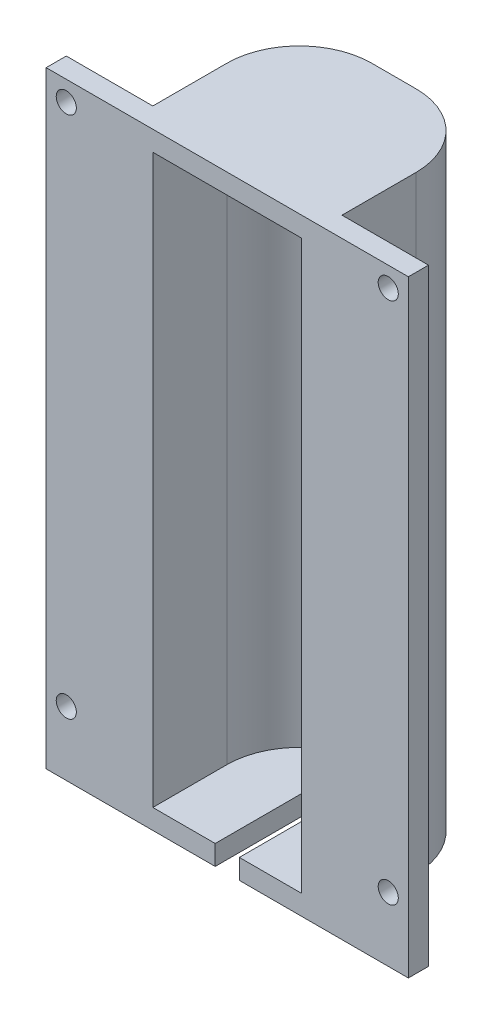
ISO-10303-21;
HEADER;
FILE_DESCRIPTION(('STEP AP214'),'2;1');
FILE_NAME('part.step','',(''),(''),'','','');
FILE_SCHEMA(('AUTOMOTIVE_DESIGN { 1 0 10303 214 1 1 1 1 }'));
ENDSEC;
DATA;
#1=APPLICATION_CONTEXT('core data for automotive mechanical design processes');
#2=APPLICATION_PROTOCOL_DEFINITION('international standard','automotive_design',2000,#1);
#3=PRODUCT_CONTEXT('',#1,'mechanical');
#4=PRODUCT('Part','Part','',(#3));
#5=PRODUCT_RELATED_PRODUCT_CATEGORY('part','',(#4));
#6=PRODUCT_DEFINITION_FORMATION('','',#4);
#7=PRODUCT_DEFINITION_CONTEXT('part definition',#1,'design');
#8=PRODUCT_DEFINITION('design','',#6,#7);
#9=PRODUCT_DEFINITION_SHAPE('','',#8);
#10=(LENGTH_UNIT() NAMED_UNIT(*) SI_UNIT(.MILLI.,.METRE.));
#11=(NAMED_UNIT(*) PLANE_ANGLE_UNIT() SI_UNIT($,.RADIAN.));
#12=(NAMED_UNIT(*) SI_UNIT($,.STERADIAN.) SOLID_ANGLE_UNIT());
#13=UNCERTAINTY_MEASURE_WITH_UNIT(LENGTH_MEASURE(1.E-05),#10,'distance_accuracy_value','');
#14=(GEOMETRIC_REPRESENTATION_CONTEXT(3) GLOBAL_UNCERTAINTY_ASSIGNED_CONTEXT((#13)) GLOBAL_UNIT_ASSIGNED_CONTEXT((#10,
#11,#12)) REPRESENTATION_CONTEXT('',''));
#15=CARTESIAN_POINT('',(0.,0.,0.));
#16=DIRECTION('',(0.,0.,1.));
#17=DIRECTION('',(1.,0.,0.));
#18=AXIS2_PLACEMENT_3D('',#15,#16,#17);
#19=CARTESIAN_POINT('',(0.,0.,18.2));
#20=DIRECTION('',(0.,0.,1.));
#21=DIRECTION('',(1.,0.,0.));
#22=AXIS2_PLACEMENT_3D('',#19,#20,#21);
#23=PLANE('',#22);
#24=CARTESIAN_POINT('',(20.0000467181837,35.25,18.2));
#25=DIRECTION('',(0.,0.,-1.));
#26=DIRECTION('',(-1.,0.,0.));
#27=AXIS2_PLACEMENT_3D('',#24,#25,#26);
#28=CIRCLE('',#27,1.24999999999999);
#29=CARTESIAN_POINT('',(18.7500467181837,35.25,18.2));
#30=VERTEX_POINT('',#29);
#31=EDGE_CURVE('E383',#30,#30,#28,.T.);
#32=ORIENTED_EDGE('',*,*,#31,.T.);
#33=EDGE_LOOP('',(#32));
#34=FACE_BOUND('',#33,.T.);
#35=CARTESIAN_POINT('',(-19.9999532818383,35.25,18.2));
#36=DIRECTION('',(0.,0.,-1.));
#37=DIRECTION('',(-1.,0.,0.));
#38=AXIS2_PLACEMENT_3D('',#35,#36,#37);
#39=CIRCLE('',#38,1.24999999999999);
#40=CARTESIAN_POINT('',(-21.2499532818383,35.25,18.2));
#41=VERTEX_POINT('',#40);
#42=EDGE_CURVE('E382',#41,#41,#39,.T.);
#43=ORIENTED_EDGE('',*,*,#42,.T.);
#44=EDGE_LOOP('',(#43));
#45=FACE_BOUND('',#44,.T.);
#46=CARTESIAN_POINT('',(-19.9999532818383,-29.75,18.2));
#47=DIRECTION('',(0.,0.,-1.));
#48=DIRECTION('',(-1.,0.,0.));
#49=AXIS2_PLACEMENT_3D('',#46,#47,#48);
#50=CIRCLE('',#49,1.24999999999999);
#51=CARTESIAN_POINT('',(-21.2499532818383,-29.75,18.2));
#52=VERTEX_POINT('',#51);
#53=EDGE_CURVE('E522',#52,#52,#50,.T.);
#54=ORIENTED_EDGE('',*,*,#53,.T.);
#55=EDGE_LOOP('',(#54));
#56=FACE_BOUND('',#55,.T.);
#57=DIRECTION('',(1.,0.,0.));
#58=VECTOR('',#57,1.);
#59=CARTESIAN_POINT('',(0.,-35.25,18.2));
#60=LINE('',#59,#58);
#61=CARTESIAN_POINT('',(1.5,-35.25,18.2));
#62=VERTEX_POINT('',#61);
#63=CARTESIAN_POINT('',(9.25,-35.25,18.2));
#64=VERTEX_POINT('',#63);
#65=EDGE_CURVE('E249',#62,#64,#60,.T.);
#66=ORIENTED_EDGE('',*,*,#65,.F.);
#67=DIRECTION('',(0.,-1.,0.));
#68=VECTOR('',#67,1.);
#69=CARTESIAN_POINT('',(1.49999999999997,0.,18.2));
#70=LINE('',#69,#68);
#71=CARTESIAN_POINT('',(1.5,-37.7250000000579,18.2));
#72=VERTEX_POINT('',#71);
#73=EDGE_CURVE('E253',#62,#72,#70,.T.);
#74=ORIENTED_EDGE('',*,*,#73,.T.);
#75=DIRECTION('',(1.,0.,0.));
#76=VECTOR('',#75,1.);
#77=CARTESIAN_POINT('',(0.,-37.7250000000579,18.2));
#78=LINE('',#77,#76);
#79=CARTESIAN_POINT('',(22.5,-37.7250000000579,18.2));
#80=VERTEX_POINT('',#79);
#81=EDGE_CURVE('E257',#72,#80,#78,.T.);
#82=ORIENTED_EDGE('',*,*,#81,.T.);
#83=DIRECTION('',(0.,1.,0.));
#84=VECTOR('',#83,1.);
#85=CARTESIAN_POINT('',(22.5,0.,18.2));
#86=LINE('',#85,#84);
#87=CARTESIAN_POINT('',(22.5,37.7250000000579,18.2));
#88=VERTEX_POINT('',#87);
#89=EDGE_CURVE('E260',#80,#88,#86,.T.);
#90=ORIENTED_EDGE('',*,*,#89,.T.);
#91=DIRECTION('',(1.,0.,0.));
#92=VECTOR('',#91,1.);
#93=CARTESIAN_POINT('',(0.,37.7250000000579,18.2));
#94=LINE('',#93,#92);
#95=CARTESIAN_POINT('',(-22.5,37.7250000000579,18.2));
#96=VERTEX_POINT('',#95);
#97=EDGE_CURVE('E264',#96,#88,#94,.T.);
#98=ORIENTED_EDGE('',*,*,#97,.F.);
#99=DIRECTION('',(0.,1.,0.));
#100=VECTOR('',#99,1.);
#101=CARTESIAN_POINT('',(-22.5,0.,18.2));
#102=LINE('',#101,#100);
#103=CARTESIAN_POINT('',(-22.5,-37.7250000000579,18.2));
#104=VERTEX_POINT('',#103);
#105=EDGE_CURVE('E268',#104,#96,#102,.T.);
#106=ORIENTED_EDGE('',*,*,#105,.F.);
#107=CARTESIAN_POINT('',(-1.5,-37.7250000000579,18.2));
#108=VERTEX_POINT('',#107);
#109=EDGE_CURVE('E261',#104,#108,#78,.T.);
#110=ORIENTED_EDGE('',*,*,#109,.T.);
#111=DIRECTION('',(0.,-1.,0.));
#112=VECTOR('',#111,1.);
#113=CARTESIAN_POINT('',(-1.49999999999997,0.,18.2));
#114=LINE('',#113,#112);
#115=CARTESIAN_POINT('',(-1.5,-35.25,18.2));
#116=VERTEX_POINT('',#115);
#117=EDGE_CURVE('E272',#116,#108,#114,.T.);
#118=ORIENTED_EDGE('',*,*,#117,.F.);
#119=CARTESIAN_POINT('',(-9.25,-35.25,18.2));
#120=VERTEX_POINT('',#119);
#121=EDGE_CURVE('E254',#120,#116,#60,.T.);
#122=ORIENTED_EDGE('',*,*,#121,.F.);
#123=DIRECTION('',(0.,1.,0.));
#124=VECTOR('',#123,1.);
#125=CARTESIAN_POINT('',(-9.25,0.,18.2));
#126=LINE('',#125,#124);
#127=CARTESIAN_POINT('',(-9.25,35.25,18.2));
#128=VERTEX_POINT('',#127);
#129=EDGE_CURVE('E276',#120,#128,#126,.T.);
#130=ORIENTED_EDGE('',*,*,#129,.T.);
#131=DIRECTION('',(1.,0.,0.));
#132=VECTOR('',#131,1.);
#133=CARTESIAN_POINT('',(0.,35.25,18.2));
#134=LINE('',#133,#132);
#135=CARTESIAN_POINT('',(9.25,35.25,18.2));
#136=VERTEX_POINT('',#135);
#137=EDGE_CURVE('E279',#128,#136,#134,.T.);
#138=ORIENTED_EDGE('',*,*,#137,.T.);
#139=DIRECTION('',(0.,1.,0.));
#140=VECTOR('',#139,1.);
#141=CARTESIAN_POINT('',(9.25,0.,18.2));
#142=LINE('',#141,#140);
#143=EDGE_CURVE('E282',#64,#136,#142,.T.);
#144=ORIENTED_EDGE('',*,*,#143,.F.);
#145=EDGE_LOOP('',(#66,#74,#82,#90,#98,#106,#110,#118,#122,#130,#138,#144));
#146=FACE_BOUND('',#145,.T.);
#147=CARTESIAN_POINT('',(20.0000467181837,-29.75,18.2));
#148=DIRECTION('',(0.,0.,-1.));
#149=DIRECTION('',(-1.,0.,0.));
#150=AXIS2_PLACEMENT_3D('',#147,#148,#149);
#151=CIRCLE('',#150,1.24999999999999);
#152=CARTESIAN_POINT('',(18.7500467181837,-29.75,18.2));
#153=VERTEX_POINT('',#152);
#154=EDGE_CURVE('E377',#153,#153,#151,.T.);
#155=ORIENTED_EDGE('',*,*,#154,.T.);
#156=EDGE_LOOP('',(#155));
#157=FACE_BOUND('',#156,.T.);
#158=ADVANCED_FACE('F43',(#34,#45,#56,#146,#157),#23,.T.);
#159=CARTESIAN_POINT('',(0.,37.7250000000579,18.2));
#160=DIRECTION('',(0.,1.,0.));
#161=DIRECTION('',(0.,0.,1.));
#162=AXIS2_PLACEMENT_3D('',#159,#160,#161);
#163=PLANE('',#162);
#164=DIRECTION('',(1.,0.,0.));
#165=VECTOR('',#164,1.);
#166=CARTESIAN_POINT('',(0.,37.7250000000579,-2.5));
#167=LINE('',#166,#165);
#168=CARTESIAN_POINT('',(-2.75,37.7250000000579,-2.5));
#169=VERTEX_POINT('',#168);
#170=CARTESIAN_POINT('',(2.75,37.7250000000579,-2.5));
#171=VERTEX_POINT('',#170);
#172=EDGE_CURVE('E235',#169,#171,#167,.T.);
#173=ORIENTED_EDGE('',*,*,#172,.F.);
#174=CARTESIAN_POINT('',(-2.75,37.7250000000579,6.5));
#175=DIRECTION('',(0.,1.,0.));
#176=DIRECTION('',(0.,0.,1.));
#177=AXIS2_PLACEMENT_3D('',#174,#175,#176);
#178=CIRCLE('',#177,9.);
#179=CARTESIAN_POINT('',(-11.75,37.7250000000579,6.5));
#180=VERTEX_POINT('',#179);
#181=EDGE_CURVE('E52',#169,#180,#178,.T.);
#182=ORIENTED_EDGE('',*,*,#181,.T.);
#183=DIRECTION('',(0.,0.,1.));
#184=VECTOR('',#183,1.);
#185=CARTESIAN_POINT('',(-11.75,37.7250000000579,18.2));
#186=LINE('',#185,#184);
#187=CARTESIAN_POINT('',(-11.75,37.7250000000579,15.7));
#188=VERTEX_POINT('',#187);
#189=EDGE_CURVE('E238',#180,#188,#186,.T.);
#190=ORIENTED_EDGE('',*,*,#189,.T.);
#191=DIRECTION('',(-1.,0.,0.));
#192=VECTOR('',#191,1.);
#193=CARTESIAN_POINT('',(0.,37.7250000000579,15.7));
#194=LINE('',#193,#192);
#195=CARTESIAN_POINT('',(-22.5,37.7250000000579,15.7));
#196=VERTEX_POINT('',#195);
#197=EDGE_CURVE('E241',#188,#196,#194,.T.);
#198=ORIENTED_EDGE('',*,*,#197,.T.);
#199=DIRECTION('',(0.,0.,-1.));
#200=VECTOR('',#199,1.);
#201=CARTESIAN_POINT('',(-22.5,37.7250000000579,18.2));
#202=LINE('',#201,#200);
#203=EDGE_CURVE('E316',#96,#196,#202,.T.);
#204=ORIENTED_EDGE('',*,*,#203,.F.);
#205=ORIENTED_EDGE('',*,*,#97,.T.);
#206=DIRECTION('',(0.,0.,-1.));
#207=VECTOR('',#206,1.);
#208=CARTESIAN_POINT('',(22.5,37.7250000000579,18.2));
#209=LINE('',#208,#207);
#210=CARTESIAN_POINT('',(22.5,37.7250000000579,15.7));
#211=VERTEX_POINT('',#210);
#212=EDGE_CURVE('E320',#88,#211,#209,.T.);
#213=ORIENTED_EDGE('',*,*,#212,.T.);
#214=DIRECTION('',(1.,0.,0.));
#215=VECTOR('',#214,1.);
#216=CARTESIAN_POINT('',(0.,37.7250000000579,15.7));
#217=LINE('',#216,#215);
#218=CARTESIAN_POINT('',(11.75,37.7250000000579,15.7));
#219=VERTEX_POINT('',#218);
#220=EDGE_CURVE('E226',#219,#211,#217,.T.);
#221=ORIENTED_EDGE('',*,*,#220,.F.);
#222=DIRECTION('',(0.,0.,1.));
#223=VECTOR('',#222,1.);
#224=CARTESIAN_POINT('',(11.75,37.7250000000579,18.2));
#225=LINE('',#224,#223);
#226=CARTESIAN_POINT('',(11.75,37.7250000000579,6.5));
#227=VERTEX_POINT('',#226);
#228=EDGE_CURVE('E184',#227,#219,#225,.T.);
#229=ORIENTED_EDGE('',*,*,#228,.F.);
#230=CARTESIAN_POINT('',(2.75,37.7250000000579,6.5));
#231=DIRECTION('',(0.,1.,0.));
#232=DIRECTION('',(0.,0.,1.));
#233=AXIS2_PLACEMENT_3D('',#230,#231,#232);
#234=CIRCLE('',#233,9.);
#235=EDGE_CURVE('E64',#227,#171,#234,.T.);
#236=ORIENTED_EDGE('',*,*,#235,.T.);
#237=EDGE_LOOP('',(#173,#182,#190,#198,#204,#205,#213,#221,#229,#236));
#238=FACE_BOUND('',#237,.T.);
#239=ADVANCED_FACE('F403',(#238),#163,.T.);
#240=CARTESIAN_POINT('',(-22.5,0.,18.2));
#241=DIRECTION('',(-1.,0.,0.));
#242=DIRECTION('',(0.,0.,1.));
#243=AXIS2_PLACEMENT_3D('',#240,#241,#242);
#244=PLANE('',#243);
#245=ORIENTED_EDGE('',*,*,#203,.T.);
#246=DIRECTION('',(0.,-1.,0.));
#247=VECTOR('',#246,1.);
#248=CARTESIAN_POINT('',(-22.5,65.2749999999421,15.7));
#249=LINE('',#248,#247);
#250=CARTESIAN_POINT('',(-22.5,-37.7250000000579,15.7));
#251=VERTEX_POINT('',#250);
#252=EDGE_CURVE('E222',#196,#251,#249,.T.);
#253=ORIENTED_EDGE('',*,*,#252,.T.);
#254=DIRECTION('',(0.,0.,-1.));
#255=VECTOR('',#254,1.);
#256=CARTESIAN_POINT('',(-22.5,-37.7250000000579,18.2));
#257=LINE('',#256,#255);
#258=EDGE_CURVE('E312',#104,#251,#257,.T.);
#259=ORIENTED_EDGE('',*,*,#258,.F.);
#260=ORIENTED_EDGE('',*,*,#105,.T.);
#261=EDGE_LOOP('',(#245,#253,#259,#260));
#262=FACE_BOUND('',#261,.T.);
#263=ADVANCED_FACE('F428',(#262),#244,.T.);
#264=CARTESIAN_POINT('',(0.,-37.7250000000579,18.2));
#265=DIRECTION('',(0.,1.,0.));
#266=DIRECTION('',(0.,0.,1.));
#267=AXIS2_PLACEMENT_3D('',#264,#265,#266);
#268=PLANE('',#267);
#269=DIRECTION('',(0.,0.,-1.));
#270=VECTOR('',#269,1.);
#271=CARTESIAN_POINT('',(-11.75,-37.7250000000579,0.));
#272=LINE('',#271,#270);
#273=CARTESIAN_POINT('',(-11.75,-37.7250000000579,15.7));
#274=VERTEX_POINT('',#273);
#275=CARTESIAN_POINT('',(-11.75,-37.7250000000579,6.5));
#276=VERTEX_POINT('',#275);
#277=EDGE_CURVE('E212',#274,#276,#272,.T.);
#278=ORIENTED_EDGE('',*,*,#277,.T.);
#279=CARTESIAN_POINT('',(-2.75,-37.7250000000579,6.5));
#280=DIRECTION('',(0.,1.,0.));
#281=DIRECTION('',(0.,0.,1.));
#282=AXIS2_PLACEMENT_3D('',#279,#280,#281);
#283=CIRCLE('',#282,9.);
#284=CARTESIAN_POINT('',(-2.75,-37.7250000000579,-2.5));
#285=VERTEX_POINT('',#284);
#286=EDGE_CURVE('E389',#276,#285,#283,.F.);
#287=ORIENTED_EDGE('',*,*,#286,.T.);
#288=DIRECTION('',(-1.,0.,0.));
#289=VECTOR('',#288,1.);
#290=CARTESIAN_POINT('',(0.,-37.7250000000579,-2.5));
#291=LINE('',#290,#289);
#292=CARTESIAN_POINT('',(2.75,-37.7250000000579,-2.5));
#293=VERTEX_POINT('',#292);
#294=EDGE_CURVE('E206',#293,#285,#291,.T.);
#295=ORIENTED_EDGE('',*,*,#294,.F.);
#296=CARTESIAN_POINT('',(2.75,-37.7250000000579,6.5));
#297=DIRECTION('',(0.,1.,0.));
#298=DIRECTION('',(0.,0.,1.));
#299=AXIS2_PLACEMENT_3D('',#296,#297,#298);
#300=CIRCLE('',#299,9.);
#301=CARTESIAN_POINT('',(11.75,-37.7250000000579,6.5));
#302=VERTEX_POINT('',#301);
#303=EDGE_CURVE('E204',#293,#302,#300,.F.);
#304=ORIENTED_EDGE('',*,*,#303,.T.);
#305=DIRECTION('',(0.,0.,-1.));
#306=VECTOR('',#305,1.);
#307=CARTESIAN_POINT('',(11.75,-37.7250000000579,0.));
#308=LINE('',#307,#306);
#309=CARTESIAN_POINT('',(11.75,-37.7250000000579,15.7));
#310=VERTEX_POINT('',#309);
#311=EDGE_CURVE('E183',#310,#302,#308,.T.);
#312=ORIENTED_EDGE('',*,*,#311,.F.);
#313=DIRECTION('',(-1.,0.,0.));
#314=VECTOR('',#313,1.);
#315=CARTESIAN_POINT('',(0.,-37.7250000000579,15.7));
#316=LINE('',#315,#314);
#317=CARTESIAN_POINT('',(22.5,-37.7250000000579,15.7));
#318=VERTEX_POINT('',#317);
#319=EDGE_CURVE('E192',#318,#310,#316,.T.);
#320=ORIENTED_EDGE('',*,*,#319,.F.);
#321=DIRECTION('',(0.,0.,-1.));
#322=VECTOR('',#321,1.);
#323=CARTESIAN_POINT('',(22.5,-37.7250000000579,18.2));
#324=LINE('',#323,#322);
#325=EDGE_CURVE('E324',#80,#318,#324,.T.);
#326=ORIENTED_EDGE('',*,*,#325,.F.);
#327=ORIENTED_EDGE('',*,*,#81,.F.);
#328=DIRECTION('',(0.,0.,-1.));
#329=VECTOR('',#328,1.);
#330=CARTESIAN_POINT('',(1.5,-37.7250000000579,18.2));
#331=LINE('',#330,#329);
#332=CARTESIAN_POINT('',(1.5,-37.7250000000579,0.0872282650120557));
#333=VERTEX_POINT('',#332);
#334=EDGE_CURVE('E327',#72,#333,#331,.T.);
#335=ORIENTED_EDGE('',*,*,#334,.T.);
#336=CARTESIAN_POINT('',(0.25,-37.7250000000579,9.));
#337=DIRECTION('',(0.,1.,0.));
#338=DIRECTION('',(0.,0.,1.));
#339=AXIS2_PLACEMENT_3D('',#336,#337,#338);
#340=CIRCLE('',#339,9.);
#341=CARTESIAN_POINT('',(0.25,-37.7250000000579,0.));
#342=VERTEX_POINT('',#341);
#343=EDGE_CURVE('E370',#333,#342,#340,.T.);
#344=ORIENTED_EDGE('',*,*,#343,.T.);
#345=DIRECTION('',(1.,0.,0.));
#346=VECTOR('',#345,1.);
#347=CARTESIAN_POINT('',(0.,-37.7250000000579,0.));
#348=LINE('',#347,#346);
#349=CARTESIAN_POINT('',(-0.25,-37.7250000000579,0.));
#350=VERTEX_POINT('',#349);
#351=EDGE_CURVE('E244',#350,#342,#348,.T.);
#352=ORIENTED_EDGE('',*,*,#351,.F.);
#353=CARTESIAN_POINT('',(-0.25,-37.7250000000579,9.));
#354=DIRECTION('',(0.,1.,0.));
#355=DIRECTION('',(0.,0.,1.));
#356=AXIS2_PLACEMENT_3D('',#353,#354,#355);
#357=CIRCLE('',#356,9.);
#358=CARTESIAN_POINT('',(-1.5,-37.7250000000579,0.0872282650120557));
#359=VERTEX_POINT('',#358);
#360=EDGE_CURVE('E367',#350,#359,#357,.T.);
#361=ORIENTED_EDGE('',*,*,#360,.T.);
#362=DIRECTION('',(0.,0.,-1.));
#363=VECTOR('',#362,1.);
#364=CARTESIAN_POINT('',(-1.5,-37.7250000000579,18.2));
#365=LINE('',#364,#363);
#366=EDGE_CURVE('E308',#108,#359,#365,.T.);
#367=ORIENTED_EDGE('',*,*,#366,.F.);
#368=ORIENTED_EDGE('',*,*,#109,.F.);
#369=ORIENTED_EDGE('',*,*,#258,.T.);
#370=DIRECTION('',(1.,0.,0.));
#371=VECTOR('',#370,1.);
#372=CARTESIAN_POINT('',(0.,-37.7250000000579,15.7));
#373=LINE('',#372,#371);
#374=EDGE_CURVE('E218',#251,#274,#373,.T.);
#375=ORIENTED_EDGE('',*,*,#374,.T.);
#376=EDGE_LOOP('',(#278,#287,#295,#304,#312,#320,#326,#327,#335,#344,#352,#361,#367,#368,#369,#375));
#377=FACE_BOUND('',#376,.T.);
#378=ADVANCED_FACE('F202',(#377),#268,.F.);
#379=CARTESIAN_POINT('',(0.,-35.25,18.2));
#380=DIRECTION('',(0.,1.,0.));
#381=DIRECTION('',(0.,0.,1.));
#382=AXIS2_PLACEMENT_3D('',#379,#380,#381);
#383=PLANE('',#382);
#384=DIRECTION('',(0.,0.,-1.));
#385=VECTOR('',#384,1.);
#386=CARTESIAN_POINT('',(9.25,-35.25,18.2));
#387=LINE('',#386,#385);
#388=CARTESIAN_POINT('',(9.25,-35.25,9.));
#389=VERTEX_POINT('',#388);
#390=EDGE_CURVE('E286',#64,#389,#387,.T.);
#391=ORIENTED_EDGE('',*,*,#390,.T.);
#392=CARTESIAN_POINT('',(0.25,-35.25,9.));
#393=DIRECTION('',(0.,1.,0.));
#394=DIRECTION('',(0.,0.,1.));
#395=AXIS2_PLACEMENT_3D('',#392,#393,#394);
#396=CIRCLE('',#395,9.);
#397=CARTESIAN_POINT('',(1.5,-35.25,0.0872282650120557));
#398=VERTEX_POINT('',#397);
#399=EDGE_CURVE('E361',#389,#398,#396,.T.);
#400=ORIENTED_EDGE('',*,*,#399,.T.);
#401=DIRECTION('',(0.,0.,-1.));
#402=VECTOR('',#401,1.);
#403=CARTESIAN_POINT('',(1.5,-35.25,18.2));
#404=LINE('',#403,#402);
#405=EDGE_CURVE('E331',#62,#398,#404,.T.);
#406=ORIENTED_EDGE('',*,*,#405,.F.);
#407=ORIENTED_EDGE('',*,*,#65,.T.);
#408=EDGE_LOOP('',(#391,#400,#406,#407));
#409=FACE_BOUND('',#408,.T.);
#410=ADVANCED_FACE('F453',(#409),#383,.T.);
#411=CARTESIAN_POINT('',(1.49999999999997,0.,18.2));
#412=DIRECTION('',(1.,0.,0.));
#413=DIRECTION('',(0.,1.,0.));
#414=AXIS2_PLACEMENT_3D('',#411,#412,#413);
#415=PLANE('',#414);
#416=ORIENTED_EDGE('',*,*,#405,.T.);
#417=DIRECTION('',(0.,-1.,0.));
#418=VECTOR('',#417,1.);
#419=CARTESIAN_POINT('',(1.5,-35.25,0.0872282650120574));
#420=LINE('',#419,#418);
#421=EDGE_CURVE('E364',#398,#333,#420,.T.);
#422=ORIENTED_EDGE('',*,*,#421,.T.);
#423=ORIENTED_EDGE('',*,*,#334,.F.);
#424=ORIENTED_EDGE('',*,*,#73,.F.);
#425=EDGE_LOOP('',(#416,#422,#423,#424));
#426=FACE_BOUND('',#425,.T.);
#427=ADVANCED_FACE('F465',(#426),#415,.F.);
#428=CARTESIAN_POINT('',(22.5,0.,18.2));
#429=DIRECTION('',(-1.,0.,0.));
#430=DIRECTION('',(0.,0.,1.));
#431=AXIS2_PLACEMENT_3D('',#428,#429,#430);
#432=PLANE('',#431);
#433=ORIENTED_EDGE('',*,*,#325,.T.);
#434=DIRECTION('',(0.,-1.,0.));
#435=VECTOR('',#434,1.);
#436=CARTESIAN_POINT('',(22.5,65.2749999999421,15.7));
#437=LINE('',#436,#435);
#438=EDGE_CURVE('E189',#211,#318,#437,.T.);
#439=ORIENTED_EDGE('',*,*,#438,.F.);
#440=ORIENTED_EDGE('',*,*,#212,.F.);
#441=ORIENTED_EDGE('',*,*,#89,.F.);
#442=EDGE_LOOP('',(#433,#439,#440,#441));
#443=FACE_BOUND('',#442,.T.);
#444=ADVANCED_FACE('F456',(#443),#432,.F.);
#445=CARTESIAN_POINT('',(-1.49999999999997,0.,18.2));
#446=DIRECTION('',(1.,0.,0.));
#447=DIRECTION('',(0.,1.,0.));
#448=AXIS2_PLACEMENT_3D('',#445,#446,#447);
#449=PLANE('',#448);
#450=ORIENTED_EDGE('',*,*,#366,.T.);
#451=DIRECTION('',(0.,1.,0.));
#452=VECTOR('',#451,1.);
#453=CARTESIAN_POINT('',(-1.5,-37.7250000000579,0.0872282650120574));
#454=LINE('',#453,#452);
#455=CARTESIAN_POINT('',(-1.5,-35.25,0.0872282650120574));
#456=VERTEX_POINT('',#455);
#457=EDGE_CURVE('E352',#359,#456,#454,.T.);
#458=ORIENTED_EDGE('',*,*,#457,.T.);
#459=DIRECTION('',(0.,0.,-1.));
#460=VECTOR('',#459,1.);
#461=CARTESIAN_POINT('',(-1.5,-35.25,18.2));
#462=LINE('',#461,#460);
#463=EDGE_CURVE('E304',#116,#456,#462,.T.);
#464=ORIENTED_EDGE('',*,*,#463,.F.);
#465=ORIENTED_EDGE('',*,*,#117,.T.);
#466=EDGE_LOOP('',(#450,#458,#464,#465));
#467=FACE_BOUND('',#466,.T.);
#468=ADVANCED_FACE('F451',(#467),#449,.T.);
#469=ORIENTED_EDGE('',*,*,#463,.T.);
#470=CARTESIAN_POINT('',(-0.25,-35.25,9.));
#471=DIRECTION('',(0.,1.,0.));
#472=DIRECTION('',(0.,0.,1.));
#473=AXIS2_PLACEMENT_3D('',#470,#471,#472);
#474=CIRCLE('',#473,9.);
#475=CARTESIAN_POINT('',(-9.25,-35.25,9.));
#476=VERTEX_POINT('',#475);
#477=EDGE_CURVE('E355',#456,#476,#474,.T.);
#478=ORIENTED_EDGE('',*,*,#477,.T.);
#479=DIRECTION('',(0.,0.,-1.));
#480=VECTOR('',#479,1.);
#481=CARTESIAN_POINT('',(-9.25,-35.25,18.2));
#482=LINE('',#481,#480);
#483=EDGE_CURVE('E300',#120,#476,#482,.T.);
#484=ORIENTED_EDGE('',*,*,#483,.F.);
#485=ORIENTED_EDGE('',*,*,#121,.T.);
#486=EDGE_LOOP('',(#469,#478,#484,#485));
#487=FACE_BOUND('',#486,.T.);
#488=ADVANCED_FACE('F447',(#487),#383,.T.);
#489=CARTESIAN_POINT('',(-9.25,0.,18.2));
#490=DIRECTION('',(-1.,0.,0.));
#491=DIRECTION('',(0.,0.,1.));
#492=AXIS2_PLACEMENT_3D('',#489,#490,#491);
#493=PLANE('',#492);
#494=ORIENTED_EDGE('',*,*,#483,.T.);
#495=DIRECTION('',(0.,1.,0.));
#496=VECTOR('',#495,1.);
#497=CARTESIAN_POINT('',(-9.25,0.,9.));
#498=LINE('',#497,#496);
#499=CARTESIAN_POINT('',(-9.25,35.25,9.));
#500=VERTEX_POINT('',#499);
#501=EDGE_CURVE('E335',#476,#500,#498,.T.);
#502=ORIENTED_EDGE('',*,*,#501,.T.);
#503=DIRECTION('',(0.,0.,-1.));
#504=VECTOR('',#503,1.);
#505=CARTESIAN_POINT('',(-9.25,35.25,18.2));
#506=LINE('',#505,#504);
#507=EDGE_CURVE('E297',#128,#500,#506,.T.);
#508=ORIENTED_EDGE('',*,*,#507,.F.);
#509=ORIENTED_EDGE('',*,*,#129,.F.);
#510=EDGE_LOOP('',(#494,#502,#508,#509));
#511=FACE_BOUND('',#510,.T.);
#512=ADVANCED_FACE('F443',(#511),#493,.F.);
#513=CARTESIAN_POINT('',(0.,35.25,18.2));
#514=DIRECTION('',(0.,1.,0.));
#515=DIRECTION('',(0.,0.,1.));
#516=AXIS2_PLACEMENT_3D('',#513,#514,#515);
#517=PLANE('',#516);
#518=ORIENTED_EDGE('',*,*,#507,.T.);
#519=CARTESIAN_POINT('',(-0.25,35.25,9.));
#520=DIRECTION('',(0.,1.,0.));
#521=DIRECTION('',(0.,0.,1.));
#522=AXIS2_PLACEMENT_3D('',#519,#520,#521);
#523=CIRCLE('',#522,9.);
#524=CARTESIAN_POINT('',(-0.25,35.25,0.));
#525=VERTEX_POINT('',#524);
#526=EDGE_CURVE('E342',#500,#525,#523,.F.);
#527=ORIENTED_EDGE('',*,*,#526,.T.);
#528=DIRECTION('',(1.,0.,0.));
#529=VECTOR('',#528,1.);
#530=CARTESIAN_POINT('',(0.,35.25,0.));
#531=LINE('',#530,#529);
#532=CARTESIAN_POINT('',(0.25,35.25,0.));
#533=VERTEX_POINT('',#532);
#534=EDGE_CURVE('E248',#525,#533,#531,.T.);
#535=ORIENTED_EDGE('',*,*,#534,.T.);
#536=CARTESIAN_POINT('',(0.25,35.25,9.));
#537=DIRECTION('',(0.,1.,0.));
#538=DIRECTION('',(0.,0.,1.));
#539=AXIS2_PLACEMENT_3D('',#536,#537,#538);
#540=CIRCLE('',#539,9.);
#541=CARTESIAN_POINT('',(9.25,35.25,9.));
#542=VERTEX_POINT('',#541);
#543=EDGE_CURVE('E339',#533,#542,#540,.F.);
#544=ORIENTED_EDGE('',*,*,#543,.T.);
#545=DIRECTION('',(0.,0.,-1.));
#546=VECTOR('',#545,1.);
#547=CARTESIAN_POINT('',(9.25,35.25,18.2));
#548=LINE('',#547,#546);
#549=EDGE_CURVE('E293',#136,#542,#548,.T.);
#550=ORIENTED_EDGE('',*,*,#549,.F.);
#551=ORIENTED_EDGE('',*,*,#137,.F.);
#552=EDGE_LOOP('',(#518,#527,#535,#544,#550,#551));
#553=FACE_BOUND('',#552,.T.);
#554=ADVANCED_FACE('F439',(#553),#517,.F.);
#555=CARTESIAN_POINT('',(9.25,0.,18.2));
#556=DIRECTION('',(-1.,0.,0.));
#557=DIRECTION('',(0.,0.,1.));
#558=AXIS2_PLACEMENT_3D('',#555,#556,#557);
#559=PLANE('',#558);
#560=ORIENTED_EDGE('',*,*,#549,.T.);
#561=DIRECTION('',(0.,1.,0.));
#562=VECTOR('',#561,1.);
#563=CARTESIAN_POINT('',(9.25,-35.25,9.));
#564=LINE('',#563,#562);
#565=EDGE_CURVE('E358',#542,#389,#564,.F.);
#566=ORIENTED_EDGE('',*,*,#565,.T.);
#567=ORIENTED_EDGE('',*,*,#390,.F.);
#568=ORIENTED_EDGE('',*,*,#143,.T.);
#569=EDGE_LOOP('',(#560,#566,#567,#568));
#570=FACE_BOUND('',#569,.T.);
#571=ADVANCED_FACE('F436',(#570),#559,.T.);
#572=CARTESIAN_POINT('',(0.,0.,0.));
#573=DIRECTION('',(0.,0.,1.));
#574=DIRECTION('',(1.,0.,0.));
#575=AXIS2_PLACEMENT_3D('',#572,#573,#574);
#576=PLANE('',#575);
#577=ORIENTED_EDGE('',*,*,#534,.F.);
#578=DIRECTION('',(0.,1.,0.));
#579=VECTOR('',#578,1.);
#580=CARTESIAN_POINT('',(-0.25,0.,0.));
#581=LINE('',#580,#579);
#582=EDGE_CURVE('E349',#525,#350,#581,.F.);
#583=ORIENTED_EDGE('',*,*,#582,.T.);
#584=ORIENTED_EDGE('',*,*,#351,.T.);
#585=DIRECTION('',(0.,1.,0.));
#586=VECTOR('',#585,1.);
#587=CARTESIAN_POINT('',(0.25,35.25,0.));
#588=LINE('',#587,#586);
#589=EDGE_CURVE('E345',#342,#533,#588,.T.);
#590=ORIENTED_EDGE('',*,*,#589,.T.);
#591=EDGE_LOOP('',(#577,#583,#584,#590));
#592=FACE_BOUND('',#591,.T.);
#593=ADVANCED_FACE('F434',(#592),#576,.T.);
#594=CARTESIAN_POINT('',(-0.25,0.,9.));
#595=DIRECTION('',(0.,1.,0.));
#596=DIRECTION('',(0.,0.,1.));
#597=AXIS2_PLACEMENT_3D('',#594,#595,#596);
#598=CYLINDRICAL_SURFACE('',#597,9.);
#599=ORIENTED_EDGE('',*,*,#360,.F.);
#600=ORIENTED_EDGE('',*,*,#582,.F.);
#601=ORIENTED_EDGE('',*,*,#526,.F.);
#602=ORIENTED_EDGE('',*,*,#501,.F.);
#603=ORIENTED_EDGE('',*,*,#477,.F.);
#604=ORIENTED_EDGE('',*,*,#457,.F.);
#605=EDGE_LOOP('',(#599,#600,#601,#602,#603,#604));
#606=FACE_BOUND('',#605,.T.);
#607=ADVANCED_FACE('F470',(#606),#598,.F.);
#608=CARTESIAN_POINT('',(0.25,0.,9.));
#609=DIRECTION('',(0.,-1.,0.));
#610=DIRECTION('',(0.,0.,-1.));
#611=AXIS2_PLACEMENT_3D('',#608,#609,#610);
#612=CYLINDRICAL_SURFACE('',#611,9.);
#613=ORIENTED_EDGE('',*,*,#399,.F.);
#614=ORIENTED_EDGE('',*,*,#565,.F.);
#615=ORIENTED_EDGE('',*,*,#543,.F.);
#616=ORIENTED_EDGE('',*,*,#589,.F.);
#617=ORIENTED_EDGE('',*,*,#343,.F.);
#618=ORIENTED_EDGE('',*,*,#421,.F.);
#619=EDGE_LOOP('',(#613,#614,#615,#616,#617,#618));
#620=FACE_BOUND('',#619,.T.);
#621=ADVANCED_FACE('F473',(#620),#612,.F.);
#622=CARTESIAN_POINT('',(0.,65.2749999999421,15.7));
#623=DIRECTION('',(0.,0.,-1.));
#624=DIRECTION('',(-1.,0.,0.));
#625=AXIS2_PLACEMENT_3D('',#622,#623,#624);
#626=PLANE('',#625);
#627=CARTESIAN_POINT('',(-19.9999532818383,35.25,15.7));
#628=DIRECTION('',(0.,0.,-1.));
#629=DIRECTION('',(-1.,0.,0.));
#630=AXIS2_PLACEMENT_3D('',#627,#628,#629);
#631=CIRCLE('',#630,1.25);
#632=CARTESIAN_POINT('',(-21.2499532818383,35.25,15.7));
#633=VERTEX_POINT('',#632);
#634=EDGE_CURVE('E514',#633,#633,#631,.T.);
#635=ORIENTED_EDGE('',*,*,#634,.F.);
#636=EDGE_LOOP('',(#635));
#637=FACE_BOUND('',#636,.T.);
#638=CARTESIAN_POINT('',(-19.9999532818383,-29.75,15.7));
#639=DIRECTION('',(0.,0.,-1.));
#640=DIRECTION('',(-1.,0.,0.));
#641=AXIS2_PLACEMENT_3D('',#638,#639,#640);
#642=CIRCLE('',#641,1.25);
#643=CARTESIAN_POINT('',(-21.2499532818383,-29.75,15.7));
#644=VERTEX_POINT('',#643);
#645=EDGE_CURVE('E518',#644,#644,#642,.T.);
#646=ORIENTED_EDGE('',*,*,#645,.F.);
#647=EDGE_LOOP('',(#646));
#648=FACE_BOUND('',#647,.T.);
#649=DIRECTION('',(0.,-1.,0.));
#650=VECTOR('',#649,1.);
#651=CARTESIAN_POINT('',(-11.75,65.2749999999421,15.7));
#652=LINE('',#651,#650);
#653=EDGE_CURVE('E188',#188,#274,#652,.T.);
#654=ORIENTED_EDGE('',*,*,#653,.T.);
#655=ORIENTED_EDGE('',*,*,#374,.F.);
#656=ORIENTED_EDGE('',*,*,#252,.F.);
#657=ORIENTED_EDGE('',*,*,#197,.F.);
#658=EDGE_LOOP('',(#654,#655,#656,#657));
#659=FACE_BOUND('',#658,.T.);
#660=ADVANCED_FACE('F476',(#637,#648,#659),#626,.T.);
#661=CARTESIAN_POINT('',(-11.75,65.2749999999421,0.));
#662=DIRECTION('',(-1.,0.,0.));
#663=DIRECTION('',(0.,0.,1.));
#664=AXIS2_PLACEMENT_3D('',#661,#662,#663);
#665=PLANE('',#664);
#666=ORIENTED_EDGE('',*,*,#189,.F.);
#667=DIRECTION('',(0.,-1.,0.));
#668=VECTOR('',#667,1.);
#669=CARTESIAN_POINT('',(-11.75,-37.7250000000579,6.5));
#670=LINE('',#669,#668);
#671=EDGE_CURVE('E373',#180,#276,#670,.T.);
#672=ORIENTED_EDGE('',*,*,#671,.T.);
#673=ORIENTED_EDGE('',*,*,#277,.F.);
#674=ORIENTED_EDGE('',*,*,#653,.F.);
#675=EDGE_LOOP('',(#666,#672,#673,#674));
#676=FACE_BOUND('',#675,.T.);
#677=ADVANCED_FACE('F410',(#676),#665,.T.);
#678=CARTESIAN_POINT('',(0.,65.2749999999421,-2.5));
#679=DIRECTION('',(0.,0.,1.));
#680=DIRECTION('',(1.,0.,0.));
#681=AXIS2_PLACEMENT_3D('',#678,#679,#680);
#682=PLANE('',#681);
#683=ORIENTED_EDGE('',*,*,#294,.T.);
#684=DIRECTION('',(0.,-1.,0.));
#685=VECTOR('',#684,1.);
#686=CARTESIAN_POINT('',(-2.75,37.7250000000579,-2.5));
#687=LINE('',#686,#685);
#688=EDGE_CURVE('E396',#285,#169,#687,.F.);
#689=ORIENTED_EDGE('',*,*,#688,.T.);
#690=ORIENTED_EDGE('',*,*,#172,.T.);
#691=DIRECTION('',(0.,-1.,0.));
#692=VECTOR('',#691,1.);
#693=CARTESIAN_POINT('',(2.75,65.2749999999421,-2.5));
#694=LINE('',#693,#692);
#695=EDGE_CURVE('E392',#171,#293,#694,.T.);
#696=ORIENTED_EDGE('',*,*,#695,.T.);
#697=EDGE_LOOP('',(#683,#689,#690,#696));
#698=FACE_BOUND('',#697,.T.);
#699=ADVANCED_FACE('F414',(#698),#682,.F.);
#700=CARTESIAN_POINT('',(11.75,65.2749999999421,0.));
#701=DIRECTION('',(-1.,0.,0.));
#702=DIRECTION('',(0.,0.,1.));
#703=AXIS2_PLACEMENT_3D('',#700,#701,#702);
#704=PLANE('',#703);
#705=ORIENTED_EDGE('',*,*,#311,.T.);
#706=DIRECTION('',(0.,-1.,0.));
#707=VECTOR('',#706,1.);
#708=CARTESIAN_POINT('',(11.75,65.2749999999421,6.5));
#709=LINE('',#708,#707);
#710=EDGE_CURVE('E11',#302,#227,#709,.F.);
#711=ORIENTED_EDGE('',*,*,#710,.T.);
#712=ORIENTED_EDGE('',*,*,#228,.T.);
#713=DIRECTION('',(0.,-1.,0.));
#714=VECTOR('',#713,1.);
#715=CARTESIAN_POINT('',(11.75,65.2749999999421,15.7));
#716=LINE('',#715,#714);
#717=EDGE_CURVE('E179',#219,#310,#716,.T.);
#718=ORIENTED_EDGE('',*,*,#717,.T.);
#719=EDGE_LOOP('',(#705,#711,#712,#718));
#720=FACE_BOUND('',#719,.T.);
#721=ADVANCED_FACE('F181',(#720),#704,.F.);
#722=CARTESIAN_POINT('',(0.,65.2749999999421,15.7));
#723=DIRECTION('',(0.,0.,1.));
#724=DIRECTION('',(1.,0.,0.));
#725=AXIS2_PLACEMENT_3D('',#722,#723,#724);
#726=PLANE('',#725);
#727=CARTESIAN_POINT('',(20.0000467181837,35.25,15.7));
#728=DIRECTION('',(0.,0.,1.));
#729=DIRECTION('',(1.,0.,0.));
#730=AXIS2_PLACEMENT_3D('',#727,#728,#729);
#731=CIRCLE('',#730,1.25);
#732=CARTESIAN_POINT('',(21.2500467181837,35.25,15.7));
#733=VERTEX_POINT('',#732);
#734=EDGE_CURVE('E378',#733,#733,#731,.T.);
#735=ORIENTED_EDGE('',*,*,#734,.T.);
#736=EDGE_LOOP('',(#735));
#737=FACE_BOUND('',#736,.T.);
#738=CARTESIAN_POINT('',(20.0000467181837,-29.75,15.7));
#739=DIRECTION('',(0.,0.,1.));
#740=DIRECTION('',(1.,0.,0.));
#741=AXIS2_PLACEMENT_3D('',#738,#739,#740);
#742=CIRCLE('',#741,1.25);
#743=CARTESIAN_POINT('',(21.2500467181837,-29.75,15.7));
#744=VERTEX_POINT('',#743);
#745=EDGE_CURVE('E199',#744,#744,#742,.T.);
#746=ORIENTED_EDGE('',*,*,#745,.T.);
#747=EDGE_LOOP('',(#746));
#748=FACE_BOUND('',#747,.T.);
#749=ORIENTED_EDGE('',*,*,#220,.T.);
#750=ORIENTED_EDGE('',*,*,#438,.T.);
#751=ORIENTED_EDGE('',*,*,#319,.T.);
#752=ORIENTED_EDGE('',*,*,#717,.F.);
#753=EDGE_LOOP('',(#749,#750,#751,#752));
#754=FACE_BOUND('',#753,.T.);
#755=ADVANCED_FACE('F193',(#737,#748,#754),#726,.F.);
#756=CARTESIAN_POINT('',(20.0000467181837,-29.75,-5.5));
#757=DIRECTION('',(0.,0.,-1.));
#758=DIRECTION('',(-1.,0.,0.));
#759=AXIS2_PLACEMENT_3D('',#756,#757,#758);
#760=CYLINDRICAL_SURFACE('',#759,1.25);
#761=ORIENTED_EDGE('',*,*,#154,.F.);
#762=EDGE_LOOP('',(#761));
#763=FACE_BOUND('',#762,.T.);
#764=ORIENTED_EDGE('',*,*,#745,.F.);
#765=EDGE_LOOP('',(#764));
#766=FACE_BOUND('',#765,.T.);
#767=ADVANCED_FACE('F542',(#763,#766),#760,.F.);
#768=CARTESIAN_POINT('',(-19.9999532818383,-29.75,-5.5));
#769=DIRECTION('',(0.,0.,-1.));
#770=DIRECTION('',(-1.,0.,0.));
#771=AXIS2_PLACEMENT_3D('',#768,#769,#770);
#772=CYLINDRICAL_SURFACE('',#771,1.25);
#773=ORIENTED_EDGE('',*,*,#645,.T.);
#774=EDGE_LOOP('',(#773));
#775=FACE_BOUND('',#774,.T.);
#776=ORIENTED_EDGE('',*,*,#53,.F.);
#777=EDGE_LOOP('',(#776));
#778=FACE_BOUND('',#777,.T.);
#779=ADVANCED_FACE('F546',(#775,#778),#772,.F.);
#780=CARTESIAN_POINT('',(-19.9999532818383,35.25,-5.5));
#781=DIRECTION('',(0.,0.,-1.));
#782=DIRECTION('',(-1.,0.,0.));
#783=AXIS2_PLACEMENT_3D('',#780,#781,#782);
#784=CYLINDRICAL_SURFACE('',#783,1.25);
#785=ORIENTED_EDGE('',*,*,#634,.T.);
#786=EDGE_LOOP('',(#785));
#787=FACE_BOUND('',#786,.T.);
#788=ORIENTED_EDGE('',*,*,#42,.F.);
#789=EDGE_LOOP('',(#788));
#790=FACE_BOUND('',#789,.T.);
#791=ADVANCED_FACE('F536',(#787,#790),#784,.F.);
#792=CARTESIAN_POINT('',(20.0000467181837,35.25,-5.5));
#793=DIRECTION('',(0.,0.,-1.));
#794=DIRECTION('',(-1.,0.,0.));
#795=AXIS2_PLACEMENT_3D('',#792,#793,#794);
#796=CYLINDRICAL_SURFACE('',#795,1.25);
#797=ORIENTED_EDGE('',*,*,#31,.F.);
#798=EDGE_LOOP('',(#797));
#799=FACE_BOUND('',#798,.T.);
#800=ORIENTED_EDGE('',*,*,#734,.F.);
#801=EDGE_LOOP('',(#800));
#802=FACE_BOUND('',#801,.T.);
#803=ADVANCED_FACE('F421',(#799,#802),#796,.F.);
#804=CARTESIAN_POINT('',(-2.75,65.2749999999421,6.5));
#805=DIRECTION('',(0.,1.,0.));
#806=DIRECTION('',(0.,0.,1.));
#807=AXIS2_PLACEMENT_3D('',#804,#805,#806);
#808=CYLINDRICAL_SURFACE('',#807,9.);
#809=ORIENTED_EDGE('',*,*,#181,.F.);
#810=ORIENTED_EDGE('',*,*,#688,.F.);
#811=ORIENTED_EDGE('',*,*,#286,.F.);
#812=ORIENTED_EDGE('',*,*,#671,.F.);
#813=EDGE_LOOP('',(#809,#810,#811,#812));
#814=FACE_BOUND('',#813,.T.);
#815=ADVANCED_FACE('F412',(#814),#808,.T.);
#816=CARTESIAN_POINT('',(2.75,65.2749999999421,6.5));
#817=DIRECTION('',(0.,-1.,0.));
#818=DIRECTION('',(0.,0.,-1.));
#819=AXIS2_PLACEMENT_3D('',#816,#817,#818);
#820=CYLINDRICAL_SURFACE('',#819,9.);
#821=ORIENTED_EDGE('',*,*,#235,.F.);
#822=ORIENTED_EDGE('',*,*,#710,.F.);
#823=ORIENTED_EDGE('',*,*,#303,.F.);
#824=ORIENTED_EDGE('',*,*,#695,.F.);
#825=EDGE_LOOP('',(#821,#822,#823,#824));
#826=FACE_BOUND('',#825,.T.);
#827=ADVANCED_FACE('F45',(#826),#820,.T.);
#828=CLOSED_SHELL('',(#158,#239,#263,#378,#410,#427,#444,#468,#488,#512,#554,#571,#593,#607,
#621,#660,#677,#699,#721,#755,#767,#779,#791,#803,#815,#827));
#829=MANIFOLD_SOLID_BREP('B2',#828);
#830=ADVANCED_BREP_SHAPE_REPRESENTATION('',(#18,#829),#14);
#831=SHAPE_DEFINITION_REPRESENTATION(#9,#830);
ENDSEC;
END-ISO-10303-21;
